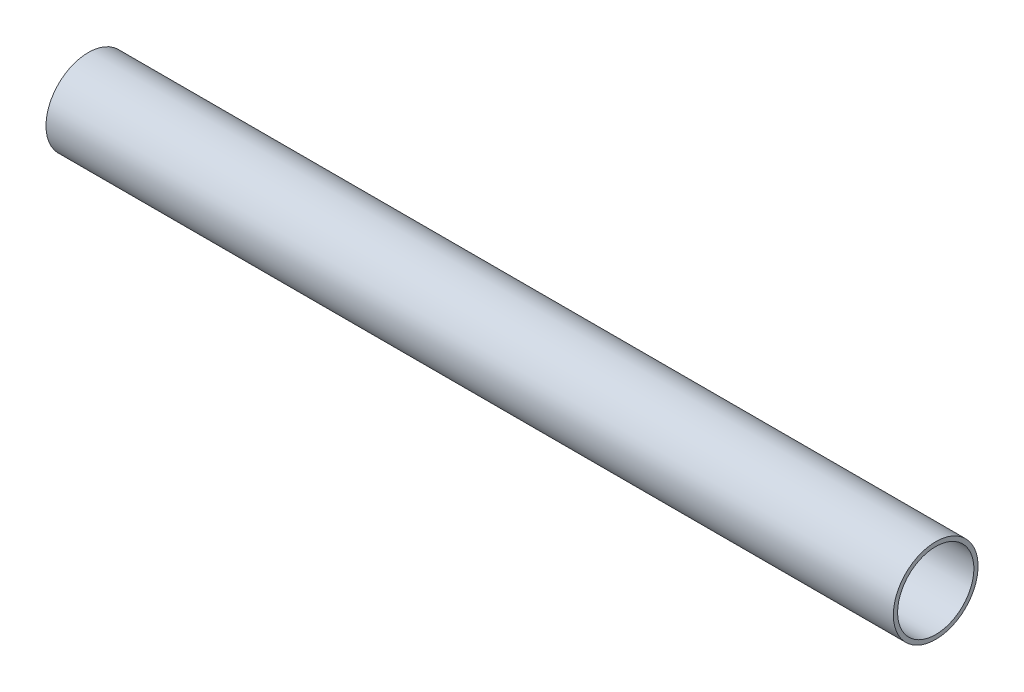
ISO-10303-21;
HEADER;
FILE_DESCRIPTION(('STEP AP214'),'2;1');
FILE_NAME('part.step','',(''),(''),'','','');
FILE_SCHEMA(('AUTOMOTIVE_DESIGN { 1 0 10303 214 1 1 1 1 }'));
ENDSEC;
DATA;
#1=APPLICATION_CONTEXT('core data for automotive mechanical design processes');
#2=APPLICATION_PROTOCOL_DEFINITION('international standard','automotive_design',2000,#1);
#3=PRODUCT_CONTEXT('',#1,'mechanical');
#4=PRODUCT('Part','Part','',(#3));
#5=PRODUCT_RELATED_PRODUCT_CATEGORY('part','',(#4));
#6=PRODUCT_DEFINITION_FORMATION('','',#4);
#7=PRODUCT_DEFINITION_CONTEXT('part definition',#1,'design');
#8=PRODUCT_DEFINITION('design','',#6,#7);
#9=PRODUCT_DEFINITION_SHAPE('','',#8);
#10=(LENGTH_UNIT() NAMED_UNIT(*) SI_UNIT(.MILLI.,.METRE.));
#11=(NAMED_UNIT(*) PLANE_ANGLE_UNIT() SI_UNIT($,.RADIAN.));
#12=(NAMED_UNIT(*) SI_UNIT($,.STERADIAN.) SOLID_ANGLE_UNIT());
#13=UNCERTAINTY_MEASURE_WITH_UNIT(LENGTH_MEASURE(1.E-05),#10,'distance_accuracy_value','');
#14=(GEOMETRIC_REPRESENTATION_CONTEXT(3) GLOBAL_UNCERTAINTY_ASSIGNED_CONTEXT((#13)) GLOBAL_UNIT_ASSIGNED_CONTEXT((#10,
#11,#12)) REPRESENTATION_CONTEXT('',''));
#15=CARTESIAN_POINT('',(0.,0.,0.));
#16=DIRECTION('',(0.,0.,1.));
#17=DIRECTION('',(1.,0.,0.));
#18=AXIS2_PLACEMENT_3D('',#15,#16,#17);
#19=CARTESIAN_POINT('',(250.,0.,0.));
#20=DIRECTION('',(-1.,0.,0.));
#21=DIRECTION('',(0.,0.,1.));
#22=AXIS2_PLACEMENT_3D('',#19,#20,#21);
#23=CYLINDRICAL_SURFACE('',#22,22.5);
#24=CARTESIAN_POINT('',(-250.,0.,0.));
#25=DIRECTION('',(-1.,0.,0.));
#26=DIRECTION('',(0.,0.,1.));
#27=AXIS2_PLACEMENT_3D('',#24,#25,#26);
#28=CIRCLE('',#27,22.5);
#29=CARTESIAN_POINT('',(-250.,0.,22.5));
#30=VERTEX_POINT('',#29);
#31=EDGE_CURVE('E27',#30,#30,#28,.T.);
#32=ORIENTED_EDGE('',*,*,#31,.T.);
#33=EDGE_LOOP('',(#32));
#34=FACE_BOUND('',#33,.T.);
#35=CARTESIAN_POINT('',(250.,0.,0.));
#36=DIRECTION('',(-1.,0.,0.));
#37=DIRECTION('',(0.,0.,1.));
#38=AXIS2_PLACEMENT_3D('',#35,#36,#37);
#39=CIRCLE('',#38,22.5);
#40=CARTESIAN_POINT('',(250.,0.,22.5));
#41=VERTEX_POINT('',#40);
#42=EDGE_CURVE('E18',#41,#41,#39,.T.);
#43=ORIENTED_EDGE('',*,*,#42,.F.);
#44=EDGE_LOOP('',(#43));
#45=FACE_BOUND('',#44,.T.);
#46=ADVANCED_FACE('F15',(#34,#45),#23,.F.);
#47=CARTESIAN_POINT('',(250.,0.,0.));
#48=DIRECTION('',(1.,0.,0.));
#49=DIRECTION('',(0.,0.,-1.));
#50=AXIS2_PLACEMENT_3D('',#47,#48,#49);
#51=PLANE('',#50);
#52=ORIENTED_EDGE('',*,*,#42,.T.);
#53=EDGE_LOOP('',(#52));
#54=FACE_BOUND('',#53,.T.);
#55=CARTESIAN_POINT('',(250.,0.,0.));
#56=DIRECTION('',(-1.,0.,0.));
#57=DIRECTION('',(0.,0.,1.));
#58=AXIS2_PLACEMENT_3D('',#55,#56,#57);
#59=CIRCLE('',#58,25.);
#60=CARTESIAN_POINT('',(250.,0.,25.));
#61=VERTEX_POINT('',#60);
#62=EDGE_CURVE('E22',#61,#61,#59,.T.);
#63=ORIENTED_EDGE('',*,*,#62,.F.);
#64=EDGE_LOOP('',(#63));
#65=FACE_BOUND('',#64,.T.);
#66=ADVANCED_FACE('F35',(#54,#65),#51,.T.);
#67=CARTESIAN_POINT('',(-250.,0.,0.));
#68=DIRECTION('',(1.,0.,0.));
#69=DIRECTION('',(0.,0.,-1.));
#70=AXIS2_PLACEMENT_3D('',#67,#68,#69);
#71=PLANE('',#70);
#72=ORIENTED_EDGE('',*,*,#31,.F.);
#73=EDGE_LOOP('',(#72));
#74=FACE_BOUND('',#73,.T.);
#75=CARTESIAN_POINT('',(-250.,0.,0.));
#76=DIRECTION('',(-1.,0.,0.));
#77=DIRECTION('',(0.,0.,1.));
#78=AXIS2_PLACEMENT_3D('',#75,#76,#77);
#79=CIRCLE('',#78,25.);
#80=CARTESIAN_POINT('',(-250.,0.,25.));
#81=VERTEX_POINT('',#80);
#82=EDGE_CURVE('E10',#81,#81,#79,.F.);
#83=ORIENTED_EDGE('',*,*,#82,.F.);
#84=EDGE_LOOP('',(#83));
#85=FACE_BOUND('',#84,.T.);
#86=ADVANCED_FACE('F43',(#74,#85),#71,.F.);
#87=CARTESIAN_POINT('',(250.,0.,0.));
#88=DIRECTION('',(-1.,0.,0.));
#89=DIRECTION('',(0.,0.,1.));
#90=AXIS2_PLACEMENT_3D('',#87,#88,#89);
#91=CYLINDRICAL_SURFACE('',#90,25.);
#92=ORIENTED_EDGE('',*,*,#82,.T.);
#93=EDGE_LOOP('',(#92));
#94=FACE_BOUND('',#93,.T.);
#95=ORIENTED_EDGE('',*,*,#62,.T.);
#96=EDGE_LOOP('',(#95));
#97=FACE_BOUND('',#96,.T.);
#98=ADVANCED_FACE('F44',(#94,#97),#91,.T.);
#99=CLOSED_SHELL('',(#46,#66,#86,#98));
#100=MANIFOLD_SOLID_BREP('B1',#99);
#101=ADVANCED_BREP_SHAPE_REPRESENTATION('',(#18,#100),#14);
#102=SHAPE_DEFINITION_REPRESENTATION(#9,#101);
ENDSEC;
END-ISO-10303-21;
